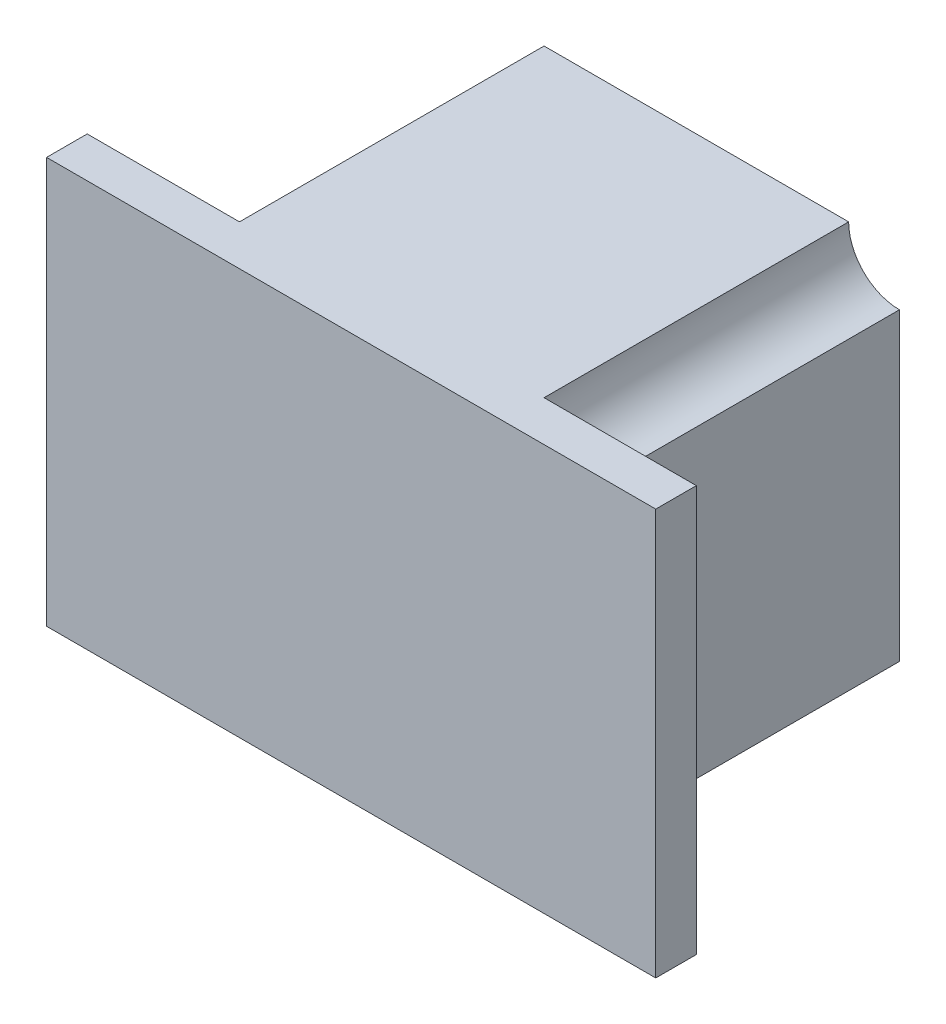
ISO-10303-21;
HEADER;
FILE_DESCRIPTION(('STEP AP214'),'2;1');
FILE_NAME('part.step','',(''),(''),'','','');
FILE_SCHEMA(('AUTOMOTIVE_DESIGN { 1 0 10303 214 1 1 1 1 }'));
ENDSEC;
DATA;
#1=APPLICATION_CONTEXT('core data for automotive mechanical design processes');
#2=APPLICATION_PROTOCOL_DEFINITION('international standard','automotive_design',2000,#1);
#3=PRODUCT_CONTEXT('',#1,'mechanical');
#4=PRODUCT('Part','Part','',(#3));
#5=PRODUCT_RELATED_PRODUCT_CATEGORY('part','',(#4));
#6=PRODUCT_DEFINITION_FORMATION('','',#4);
#7=PRODUCT_DEFINITION_CONTEXT('part definition',#1,'design');
#8=PRODUCT_DEFINITION('design','',#6,#7);
#9=PRODUCT_DEFINITION_SHAPE('','',#8);
#10=(LENGTH_UNIT() NAMED_UNIT(*) SI_UNIT(.MILLI.,.METRE.));
#11=(NAMED_UNIT(*) PLANE_ANGLE_UNIT() SI_UNIT($,.RADIAN.));
#12=(NAMED_UNIT(*) SI_UNIT($,.STERADIAN.) SOLID_ANGLE_UNIT());
#13=UNCERTAINTY_MEASURE_WITH_UNIT(LENGTH_MEASURE(1.E-05),#10,'distance_accuracy_value','');
#14=(GEOMETRIC_REPRESENTATION_CONTEXT(3) GLOBAL_UNCERTAINTY_ASSIGNED_CONTEXT((#13)) GLOBAL_UNIT_ASSIGNED_CONTEXT((#10,
#11,#12)) REPRESENTATION_CONTEXT('',''));
#15=CARTESIAN_POINT('',(0.,0.,0.));
#16=DIRECTION('',(0.,0.,1.));
#17=DIRECTION('',(1.,0.,0.));
#18=AXIS2_PLACEMENT_3D('',#15,#16,#17);
#19=CARTESIAN_POINT('',(0.,0.,0.));
#20=DIRECTION('',(0.,0.,-1.));
#21=DIRECTION('',(-1.,0.,0.));
#22=AXIS2_PLACEMENT_3D('',#19,#20,#21);
#23=PLANE('',#22);
#24=DIRECTION('',(1.,0.,0.));
#25=VECTOR('',#24,1.);
#26=CARTESIAN_POINT('',(-150.,-100.,0.));
#27=LINE('',#26,#25);
#28=CARTESIAN_POINT('',(75.,-100.,0.));
#29=VERTEX_POINT('',#28);
#30=CARTESIAN_POINT('',(150.,-100.,0.));
#31=VERTEX_POINT('',#30);
#32=EDGE_CURVE('E84',#29,#31,#27,.T.);
#33=ORIENTED_EDGE('',*,*,#32,.F.);
#34=CARTESIAN_POINT('',(100.,-100.,0.));
#35=DIRECTION('',(0.,0.,-1.));
#36=DIRECTION('',(-1.,0.,0.));
#37=AXIS2_PLACEMENT_3D('',#34,#35,#36);
#38=CIRCLE('',#37,25.);
#39=CARTESIAN_POINT('',(100.,-75.,0.));
#40=VERTEX_POINT('',#39);
#41=EDGE_CURVE('E154',#29,#40,#38,.T.);
#42=ORIENTED_EDGE('',*,*,#41,.T.);
#43=DIRECTION('',(0.,1.,0.));
#44=VECTOR('',#43,1.);
#45=CARTESIAN_POINT('',(100.,0.,0.));
#46=LINE('',#45,#44);
#47=CARTESIAN_POINT('',(100.,75.,0.));
#48=VERTEX_POINT('',#47);
#49=EDGE_CURVE('E316',#40,#48,#46,.T.);
#50=ORIENTED_EDGE('',*,*,#49,.T.);
#51=CARTESIAN_POINT('',(100.,100.,0.));
#52=DIRECTION('',(0.,0.,-1.));
#53=DIRECTION('',(-1.,0.,0.));
#54=AXIS2_PLACEMENT_3D('',#51,#52,#53);
#55=CIRCLE('',#54,25.);
#56=CARTESIAN_POINT('',(75.,100.,0.));
#57=VERTEX_POINT('',#56);
#58=EDGE_CURVE('E155',#48,#57,#55,.T.);
#59=ORIENTED_EDGE('',*,*,#58,.T.);
#60=DIRECTION('',(-1.,0.,0.));
#61=VECTOR('',#60,1.);
#62=CARTESIAN_POINT('',(-150.,100.,0.));
#63=LINE('',#62,#61);
#64=CARTESIAN_POINT('',(150.,100.,0.));
#65=VERTEX_POINT('',#64);
#66=EDGE_CURVE('E194',#65,#57,#63,.T.);
#67=ORIENTED_EDGE('',*,*,#66,.F.);
#68=DIRECTION('',(0.,1.,0.));
#69=VECTOR('',#68,1.);
#70=CARTESIAN_POINT('',(150.,-100.,0.));
#71=LINE('',#70,#69);
#72=EDGE_CURVE('E171',#31,#65,#71,.T.);
#73=ORIENTED_EDGE('',*,*,#72,.F.);
#74=EDGE_LOOP('',(#33,#42,#50,#59,#67,#73));
#75=FACE_BOUND('',#74,.T.);
#76=ADVANCED_FACE('F41',(#75),#23,.T.);
#77=CARTESIAN_POINT('',(150.,-100.,20.));
#78=DIRECTION('',(-1.,0.,0.));
#79=DIRECTION('',(0.,0.,1.));
#80=AXIS2_PLACEMENT_3D('',#77,#78,#79);
#81=PLANE('',#80);
#82=ORIENTED_EDGE('',*,*,#72,.T.);
#83=DIRECTION('',(0.,0.,-1.));
#84=VECTOR('',#83,1.);
#85=CARTESIAN_POINT('',(150.,100.,20.));
#86=LINE('',#85,#84);
#87=CARTESIAN_POINT('',(150.,100.,20.));
#88=VERTEX_POINT('',#87);
#89=EDGE_CURVE('E211',#88,#65,#86,.T.);
#90=ORIENTED_EDGE('',*,*,#89,.F.);
#91=DIRECTION('',(0.,1.,0.));
#92=VECTOR('',#91,1.);
#93=CARTESIAN_POINT('',(150.,-100.,20.));
#94=LINE('',#93,#92);
#95=CARTESIAN_POINT('',(150.,-100.,20.));
#96=VERTEX_POINT('',#95);
#97=EDGE_CURVE('E182',#96,#88,#94,.T.);
#98=ORIENTED_EDGE('',*,*,#97,.F.);
#99=DIRECTION('',(0.,0.,-1.));
#100=VECTOR('',#99,1.);
#101=CARTESIAN_POINT('',(150.,-100.,20.));
#102=LINE('',#101,#100);
#103=EDGE_CURVE('E192',#96,#31,#102,.T.);
#104=ORIENTED_EDGE('',*,*,#103,.T.);
#105=EDGE_LOOP('',(#82,#90,#98,#104));
#106=FACE_BOUND('',#105,.T.);
#107=ADVANCED_FACE('F277',(#106),#81,.F.);
#108=CARTESIAN_POINT('',(-150.,100.,20.));
#109=DIRECTION('',(0.,-1.,0.));
#110=DIRECTION('',(0.,0.,-1.));
#111=AXIS2_PLACEMENT_3D('',#108,#109,#110);
#112=PLANE('',#111);
#113=ORIENTED_EDGE('',*,*,#66,.T.);
#114=DIRECTION('',(0.,0.,1.));
#115=VECTOR('',#114,1.);
#116=CARTESIAN_POINT('',(75.,100.,-150.));
#117=LINE('',#116,#115);
#118=CARTESIAN_POINT('',(75.,100.,-150.));
#119=VERTEX_POINT('',#118);
#120=EDGE_CURVE('E309',#119,#57,#117,.T.);
#121=ORIENTED_EDGE('',*,*,#120,.F.);
#122=DIRECTION('',(1.,0.,0.));
#123=VECTOR('',#122,1.);
#124=CARTESIAN_POINT('',(0.,100.,-150.));
#125=LINE('',#124,#123);
#126=CARTESIAN_POINT('',(-75.,100.,-150.));
#127=VERTEX_POINT('',#126);
#128=EDGE_CURVE('E148',#127,#119,#125,.T.);
#129=ORIENTED_EDGE('',*,*,#128,.F.);
#130=DIRECTION('',(0.,0.,1.));
#131=VECTOR('',#130,1.);
#132=CARTESIAN_POINT('',(-75.,100.,-150.));
#133=LINE('',#132,#131);
#134=CARTESIAN_POINT('',(-75.,100.,0.));
#135=VERTEX_POINT('',#134);
#136=EDGE_CURVE('E254',#127,#135,#133,.T.);
#137=ORIENTED_EDGE('',*,*,#136,.T.);
#138=CARTESIAN_POINT('',(-150.,100.,0.));
#139=VERTEX_POINT('',#138);
#140=EDGE_CURVE('E176',#135,#139,#63,.T.);
#141=ORIENTED_EDGE('',*,*,#140,.T.);
#142=DIRECTION('',(0.,0.,-1.));
#143=VECTOR('',#142,1.);
#144=CARTESIAN_POINT('',(-150.,100.,20.));
#145=LINE('',#144,#143);
#146=CARTESIAN_POINT('',(-150.,100.,20.));
#147=VERTEX_POINT('',#146);
#148=EDGE_CURVE('E208',#147,#139,#145,.T.);
#149=ORIENTED_EDGE('',*,*,#148,.F.);
#150=DIRECTION('',(-1.,0.,0.));
#151=VECTOR('',#150,1.);
#152=CARTESIAN_POINT('',(-150.,100.,20.));
#153=LINE('',#152,#151);
#154=EDGE_CURVE('E92',#88,#147,#153,.T.);
#155=ORIENTED_EDGE('',*,*,#154,.F.);
#156=ORIENTED_EDGE('',*,*,#89,.T.);
#157=EDGE_LOOP('',(#113,#121,#129,#137,#141,#149,#155,#156));
#158=FACE_BOUND('',#157,.T.);
#159=ADVANCED_FACE('F267',(#158),#112,.F.);
#160=CARTESIAN_POINT('',(-150.,-100.,20.));
#161=DIRECTION('',(1.,0.,0.));
#162=DIRECTION('',(0.,0.,-1.));
#163=AXIS2_PLACEMENT_3D('',#160,#161,#162);
#164=PLANE('',#163);
#165=DIRECTION('',(0.,-1.,0.));
#166=VECTOR('',#165,1.);
#167=CARTESIAN_POINT('',(-150.,-100.,0.));
#168=LINE('',#167,#166);
#169=CARTESIAN_POINT('',(-150.,-100.,0.));
#170=VERTEX_POINT('',#169);
#171=EDGE_CURVE('E77',#139,#170,#168,.T.);
#172=ORIENTED_EDGE('',*,*,#171,.T.);
#173=DIRECTION('',(0.,0.,-1.));
#174=VECTOR('',#173,1.);
#175=CARTESIAN_POINT('',(-150.,-100.,20.));
#176=LINE('',#175,#174);
#177=CARTESIAN_POINT('',(-150.,-100.,20.));
#178=VERTEX_POINT('',#177);
#179=EDGE_CURVE('E205',#178,#170,#176,.T.);
#180=ORIENTED_EDGE('',*,*,#179,.F.);
#181=DIRECTION('',(0.,-1.,0.));
#182=VECTOR('',#181,1.);
#183=CARTESIAN_POINT('',(-150.,-100.,20.));
#184=LINE('',#183,#182);
#185=EDGE_CURVE('E188',#147,#178,#184,.T.);
#186=ORIENTED_EDGE('',*,*,#185,.F.);
#187=ORIENTED_EDGE('',*,*,#148,.T.);
#188=EDGE_LOOP('',(#172,#180,#186,#187));
#189=FACE_BOUND('',#188,.T.);
#190=ADVANCED_FACE('F271',(#189),#164,.F.);
#191=CARTESIAN_POINT('',(-150.,-100.,20.));
#192=DIRECTION('',(0.,1.,0.));
#193=DIRECTION('',(0.,0.,1.));
#194=AXIS2_PLACEMENT_3D('',#191,#192,#193);
#195=PLANE('',#194);
#196=CARTESIAN_POINT('',(-75.,-100.,0.));
#197=VERTEX_POINT('',#196);
#198=EDGE_CURVE('E185',#170,#197,#27,.T.);
#199=ORIENTED_EDGE('',*,*,#198,.T.);
#200=DIRECTION('',(0.,0.,1.));
#201=VECTOR('',#200,1.);
#202=CARTESIAN_POINT('',(-75.,-100.,-150.));
#203=LINE('',#202,#201);
#204=CARTESIAN_POINT('',(-75.,-100.,-150.));
#205=VERTEX_POINT('',#204);
#206=EDGE_CURVE('E249',#205,#197,#203,.T.);
#207=ORIENTED_EDGE('',*,*,#206,.F.);
#208=DIRECTION('',(-1.,0.,0.));
#209=VECTOR('',#208,1.);
#210=CARTESIAN_POINT('',(0.,-100.,-150.));
#211=LINE('',#210,#209);
#212=CARTESIAN_POINT('',(75.,-100.,-150.));
#213=VERTEX_POINT('',#212);
#214=EDGE_CURVE('E166',#213,#205,#211,.T.);
#215=ORIENTED_EDGE('',*,*,#214,.F.);
#216=DIRECTION('',(0.,0.,1.));
#217=VECTOR('',#216,1.);
#218=CARTESIAN_POINT('',(75.,-100.,-150.));
#219=LINE('',#218,#217);
#220=EDGE_CURVE('E178',#213,#29,#219,.T.);
#221=ORIENTED_EDGE('',*,*,#220,.T.);
#222=ORIENTED_EDGE('',*,*,#32,.T.);
#223=ORIENTED_EDGE('',*,*,#103,.F.);
#224=DIRECTION('',(1.,0.,0.));
#225=VECTOR('',#224,1.);
#226=CARTESIAN_POINT('',(-150.,-100.,20.));
#227=LINE('',#226,#225);
#228=EDGE_CURVE('E59',#178,#96,#227,.T.);
#229=ORIENTED_EDGE('',*,*,#228,.F.);
#230=ORIENTED_EDGE('',*,*,#179,.T.);
#231=EDGE_LOOP('',(#199,#207,#215,#221,#222,#223,#229,#230));
#232=FACE_BOUND('',#231,.T.);
#233=ADVANCED_FACE('F259',(#232),#195,.F.);
#234=CARTESIAN_POINT('',(0.,0.,20.));
#235=DIRECTION('',(0.,0.,-1.));
#236=DIRECTION('',(-1.,0.,0.));
#237=AXIS2_PLACEMENT_3D('',#234,#235,#236);
#238=PLANE('',#237);
#239=ORIENTED_EDGE('',*,*,#97,.T.);
#240=ORIENTED_EDGE('',*,*,#154,.T.);
#241=ORIENTED_EDGE('',*,*,#185,.T.);
#242=ORIENTED_EDGE('',*,*,#228,.T.);
#243=EDGE_LOOP('',(#239,#240,#241,#242));
#244=FACE_BOUND('',#243,.T.);
#245=ADVANCED_FACE('F278',(#244),#238,.F.);
#246=DIRECTION('',(0.,1.,0.));
#247=VECTOR('',#246,1.);
#248=CARTESIAN_POINT('',(-100.,0.,0.));
#249=LINE('',#248,#247);
#250=CARTESIAN_POINT('',(-100.,-75.,0.));
#251=VERTEX_POINT('',#250);
#252=CARTESIAN_POINT('',(-100.,75.,0.));
#253=VERTEX_POINT('',#252);
#254=EDGE_CURVE('E167',#251,#253,#249,.T.);
#255=ORIENTED_EDGE('',*,*,#254,.F.);
#256=CARTESIAN_POINT('',(-100.,-100.,0.));
#257=DIRECTION('',(0.,0.,-1.));
#258=DIRECTION('',(-1.,0.,0.));
#259=AXIS2_PLACEMENT_3D('',#256,#257,#258);
#260=CIRCLE('',#259,25.);
#261=EDGE_CURVE('E221',#251,#197,#260,.T.);
#262=ORIENTED_EDGE('',*,*,#261,.T.);
#263=ORIENTED_EDGE('',*,*,#198,.F.);
#264=ORIENTED_EDGE('',*,*,#171,.F.);
#265=ORIENTED_EDGE('',*,*,#140,.F.);
#266=CARTESIAN_POINT('',(-100.,100.,0.));
#267=DIRECTION('',(0.,0.,-1.));
#268=DIRECTION('',(-1.,0.,0.));
#269=AXIS2_PLACEMENT_3D('',#266,#267,#268);
#270=CIRCLE('',#269,25.);
#271=EDGE_CURVE('E218',#135,#253,#270,.T.);
#272=ORIENTED_EDGE('',*,*,#271,.T.);
#273=EDGE_LOOP('',(#255,#262,#263,#264,#265,#272));
#274=FACE_BOUND('',#273,.T.);
#275=ADVANCED_FACE('F273',(#274),#23,.T.);
#276=CARTESIAN_POINT('',(100.,0.,-150.));
#277=DIRECTION('',(1.,0.,0.));
#278=DIRECTION('',(0.,0.,-1.));
#279=AXIS2_PLACEMENT_3D('',#276,#277,#278);
#280=PLANE('',#279);
#281=ORIENTED_EDGE('',*,*,#49,.F.);
#282=DIRECTION('',(0.,0.,1.));
#283=VECTOR('',#282,1.);
#284=CARTESIAN_POINT('',(100.,-75.,-150.));
#285=LINE('',#284,#283);
#286=CARTESIAN_POINT('',(100.,-75.,-150.));
#287=VERTEX_POINT('',#286);
#288=EDGE_CURVE('E164',#287,#40,#285,.T.);
#289=ORIENTED_EDGE('',*,*,#288,.F.);
#290=DIRECTION('',(0.,1.,0.));
#291=VECTOR('',#290,1.);
#292=CARTESIAN_POINT('',(100.,0.,-150.));
#293=LINE('',#292,#291);
#294=CARTESIAN_POINT('',(100.,75.,-150.));
#295=VERTEX_POINT('',#294);
#296=EDGE_CURVE('E145',#287,#295,#293,.T.);
#297=ORIENTED_EDGE('',*,*,#296,.T.);
#298=DIRECTION('',(0.,0.,1.));
#299=VECTOR('',#298,1.);
#300=CARTESIAN_POINT('',(100.,75.,-150.));
#301=LINE('',#300,#299);
#302=EDGE_CURVE('E161',#295,#48,#301,.T.);
#303=ORIENTED_EDGE('',*,*,#302,.T.);
#304=EDGE_LOOP('',(#281,#289,#297,#303));
#305=FACE_BOUND('',#304,.T.);
#306=ADVANCED_FACE('F160',(#305),#280,.T.);
#307=CARTESIAN_POINT('',(-100.,0.,-150.));
#308=DIRECTION('',(1.,0.,0.));
#309=DIRECTION('',(0.,0.,-1.));
#310=AXIS2_PLACEMENT_3D('',#307,#308,#309);
#311=PLANE('',#310);
#312=ORIENTED_EDGE('',*,*,#254,.T.);
#313=DIRECTION('',(0.,0.,1.));
#314=VECTOR('',#313,1.);
#315=CARTESIAN_POINT('',(-100.,75.,-150.));
#316=LINE('',#315,#314);
#317=CARTESIAN_POINT('',(-100.,75.,-150.));
#318=VERTEX_POINT('',#317);
#319=EDGE_CURVE('E243',#318,#253,#316,.T.);
#320=ORIENTED_EDGE('',*,*,#319,.F.);
#321=DIRECTION('',(0.,1.,0.));
#322=VECTOR('',#321,1.);
#323=CARTESIAN_POINT('',(-100.,0.,-150.));
#324=LINE('',#323,#322);
#325=CARTESIAN_POINT('',(-100.,-75.,-150.));
#326=VERTEX_POINT('',#325);
#327=EDGE_CURVE('E229',#326,#318,#324,.T.);
#328=ORIENTED_EDGE('',*,*,#327,.F.);
#329=DIRECTION('',(0.,0.,1.));
#330=VECTOR('',#329,1.);
#331=CARTESIAN_POINT('',(-100.,-75.,-150.));
#332=LINE('',#331,#330);
#333=EDGE_CURVE('E240',#326,#251,#332,.T.);
#334=ORIENTED_EDGE('',*,*,#333,.T.);
#335=EDGE_LOOP('',(#312,#320,#328,#334));
#336=FACE_BOUND('',#335,.T.);
#337=ADVANCED_FACE('F239',(#336),#311,.F.);
#338=CARTESIAN_POINT('',(0.,0.,-150.));
#339=DIRECTION('',(0.,0.,-1.));
#340=DIRECTION('',(-1.,0.,0.));
#341=AXIS2_PLACEMENT_3D('',#338,#339,#340);
#342=PLANE('',#341);
#343=ORIENTED_EDGE('',*,*,#128,.T.);
#344=CARTESIAN_POINT('',(100.,100.,-150.));
#345=DIRECTION('',(0.,0.,-1.));
#346=DIRECTION('',(-1.,0.,0.));
#347=AXIS2_PLACEMENT_3D('',#344,#345,#346);
#348=CIRCLE('',#347,25.);
#349=EDGE_CURVE('E142',#119,#295,#348,.F.);
#350=ORIENTED_EDGE('',*,*,#349,.T.);
#351=ORIENTED_EDGE('',*,*,#296,.F.);
#352=CARTESIAN_POINT('',(100.,-100.,-150.));
#353=DIRECTION('',(0.,0.,-1.));
#354=DIRECTION('',(-1.,0.,0.));
#355=AXIS2_PLACEMENT_3D('',#352,#353,#354);
#356=CIRCLE('',#355,25.);
#357=EDGE_CURVE('E224',#287,#213,#356,.F.);
#358=ORIENTED_EDGE('',*,*,#357,.T.);
#359=ORIENTED_EDGE('',*,*,#214,.T.);
#360=CARTESIAN_POINT('',(-100.,-100.,-150.));
#361=DIRECTION('',(0.,0.,-1.));
#362=DIRECTION('',(-1.,0.,0.));
#363=AXIS2_PLACEMENT_3D('',#360,#361,#362);
#364=CIRCLE('',#363,25.);
#365=EDGE_CURVE('E51',#205,#326,#364,.F.);
#366=ORIENTED_EDGE('',*,*,#365,.T.);
#367=ORIENTED_EDGE('',*,*,#327,.T.);
#368=CARTESIAN_POINT('',(-100.,100.,-150.));
#369=DIRECTION('',(0.,0.,-1.));
#370=DIRECTION('',(-1.,0.,0.));
#371=AXIS2_PLACEMENT_3D('',#368,#369,#370);
#372=CIRCLE('',#371,25.);
#373=EDGE_CURVE('E11',#318,#127,#372,.F.);
#374=ORIENTED_EDGE('',*,*,#373,.T.);
#375=EDGE_LOOP('',(#343,#350,#351,#358,#359,#366,#367,#374));
#376=FACE_BOUND('',#375,.T.);
#377=ADVANCED_FACE('F144',(#376),#342,.T.);
#378=CARTESIAN_POINT('',(100.,100.,-150.));
#379=DIRECTION('',(0.,0.,-1.));
#380=DIRECTION('',(-1.,0.,0.));
#381=AXIS2_PLACEMENT_3D('',#378,#379,#380);
#382=CYLINDRICAL_SURFACE('',#381,25.);
#383=ORIENTED_EDGE('',*,*,#349,.F.);
#384=ORIENTED_EDGE('',*,*,#120,.T.);
#385=ORIENTED_EDGE('',*,*,#58,.F.);
#386=ORIENTED_EDGE('',*,*,#302,.F.);
#387=EDGE_LOOP('',(#383,#384,#385,#386));
#388=FACE_BOUND('',#387,.T.);
#389=ADVANCED_FACE('F169',(#388),#382,.F.);
#390=CARTESIAN_POINT('',(100.,-100.,-150.));
#391=DIRECTION('',(0.,0.,1.));
#392=DIRECTION('',(1.,0.,0.));
#393=AXIS2_PLACEMENT_3D('',#390,#391,#392);
#394=CYLINDRICAL_SURFACE('',#393,25.);
#395=ORIENTED_EDGE('',*,*,#357,.F.);
#396=ORIENTED_EDGE('',*,*,#288,.T.);
#397=ORIENTED_EDGE('',*,*,#41,.F.);
#398=ORIENTED_EDGE('',*,*,#220,.F.);
#399=EDGE_LOOP('',(#395,#396,#397,#398));
#400=FACE_BOUND('',#399,.T.);
#401=ADVANCED_FACE('F300',(#400),#394,.F.);
#402=CARTESIAN_POINT('',(-100.,-100.,-150.));
#403=DIRECTION('',(0.,0.,-1.));
#404=DIRECTION('',(-1.,0.,0.));
#405=AXIS2_PLACEMENT_3D('',#402,#403,#404);
#406=CYLINDRICAL_SURFACE('',#405,25.);
#407=ORIENTED_EDGE('',*,*,#365,.F.);
#408=ORIENTED_EDGE('',*,*,#206,.T.);
#409=ORIENTED_EDGE('',*,*,#261,.F.);
#410=ORIENTED_EDGE('',*,*,#333,.F.);
#411=EDGE_LOOP('',(#407,#408,#409,#410));
#412=FACE_BOUND('',#411,.T.);
#413=ADVANCED_FACE('F247',(#412),#406,.F.);
#414=CARTESIAN_POINT('',(-100.,100.,-150.));
#415=DIRECTION('',(0.,0.,1.));
#416=DIRECTION('',(1.,0.,0.));
#417=AXIS2_PLACEMENT_3D('',#414,#415,#416);
#418=CYLINDRICAL_SURFACE('',#417,25.);
#419=ORIENTED_EDGE('',*,*,#373,.F.);
#420=ORIENTED_EDGE('',*,*,#319,.T.);
#421=ORIENTED_EDGE('',*,*,#271,.F.);
#422=ORIENTED_EDGE('',*,*,#136,.F.);
#423=EDGE_LOOP('',(#419,#420,#421,#422));
#424=FACE_BOUND('',#423,.T.);
#425=ADVANCED_FACE('F43',(#424),#418,.F.);
#426=CLOSED_SHELL('',(#76,#107,#159,#190,#233,#245,#275,#306,#337,#377,#389,#401,#413,#425));
#427=MANIFOLD_SOLID_BREP('B2',#426);
#428=ADVANCED_BREP_SHAPE_REPRESENTATION('',(#18,#427),#14);
#429=SHAPE_DEFINITION_REPRESENTATION(#9,#428);
ENDSEC;
END-ISO-10303-21;
